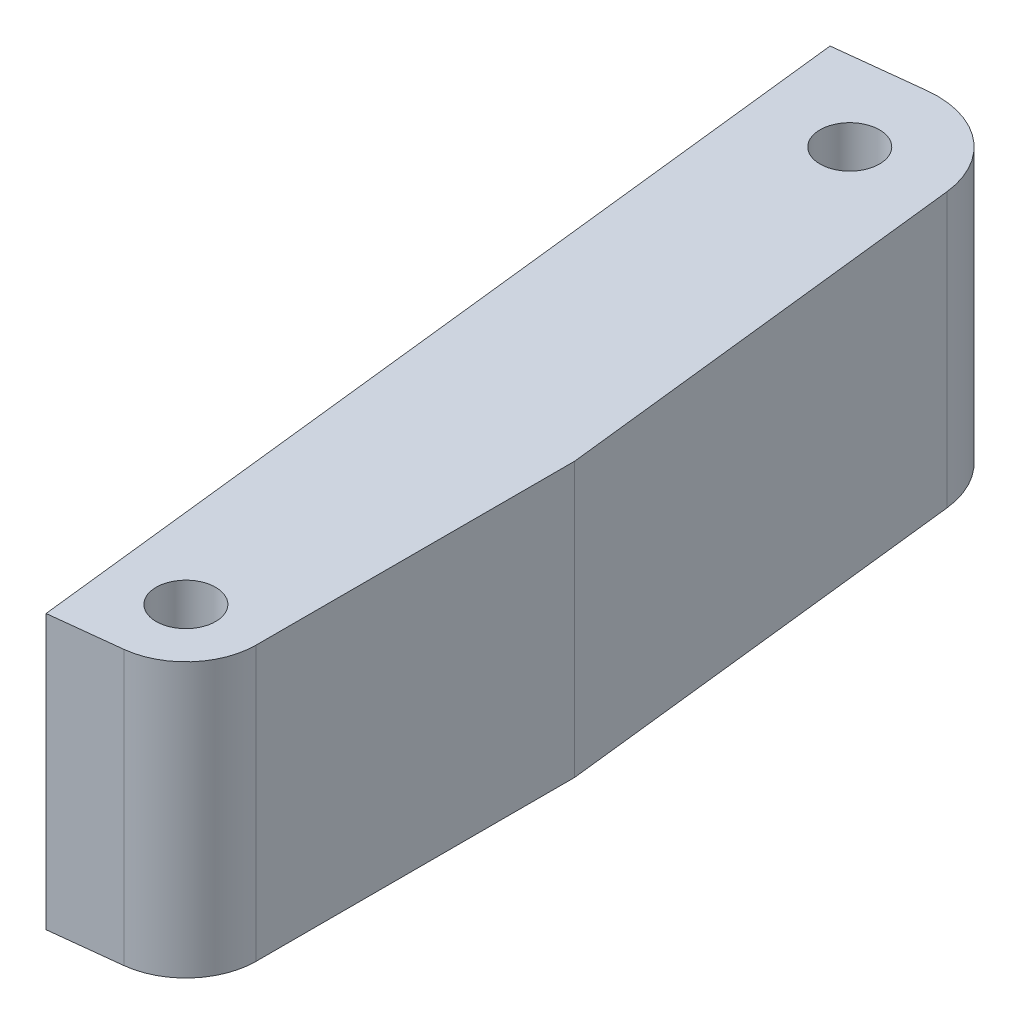
ISO-10303-21;
HEADER;
FILE_DESCRIPTION(('STEP AP214'),'2;1');
FILE_NAME('part.step','',(''),(''),'','','');
FILE_SCHEMA(('AUTOMOTIVE_DESIGN { 1 0 10303 214 1 1 1 1 }'));
ENDSEC;
DATA;
#1=APPLICATION_CONTEXT('core data for automotive mechanical design processes');
#2=APPLICATION_PROTOCOL_DEFINITION('international standard','automotive_design',2000,#1);
#3=PRODUCT_CONTEXT('',#1,'mechanical');
#4=PRODUCT('Part','Part','',(#3));
#5=PRODUCT_RELATED_PRODUCT_CATEGORY('part','',(#4));
#6=PRODUCT_DEFINITION_FORMATION('','',#4);
#7=PRODUCT_DEFINITION_CONTEXT('part definition',#1,'design');
#8=PRODUCT_DEFINITION('design','',#6,#7);
#9=PRODUCT_DEFINITION_SHAPE('','',#8);
#10=(LENGTH_UNIT() NAMED_UNIT(*) SI_UNIT(.MILLI.,.METRE.));
#11=(NAMED_UNIT(*) PLANE_ANGLE_UNIT() SI_UNIT($,.RADIAN.));
#12=(NAMED_UNIT(*) SI_UNIT($,.STERADIAN.) SOLID_ANGLE_UNIT());
#13=UNCERTAINTY_MEASURE_WITH_UNIT(LENGTH_MEASURE(1.E-05),#10,'distance_accuracy_value','');
#14=(GEOMETRIC_REPRESENTATION_CONTEXT(3) GLOBAL_UNCERTAINTY_ASSIGNED_CONTEXT((#13)) GLOBAL_UNIT_ASSIGNED_CONTEXT((#10,
#11,#12)) REPRESENTATION_CONTEXT('',''));
#15=CARTESIAN_POINT('',(0.,0.,0.));
#16=DIRECTION('',(0.,0.,1.));
#17=DIRECTION('',(1.,0.,0.));
#18=AXIS2_PLACEMENT_3D('',#15,#16,#17);
#19=CARTESIAN_POINT('',(-11.0299029445429,0.,55.3295229184585));
#20=DIRECTION('',(0.993723873247903,0.,-0.111860912463582));
#21=DIRECTION('',(-0.111860912463582,0.,-0.993723873247903));
#22=AXIS2_PLACEMENT_3D('',#19,#20,#21);
#23=PLANE('',#22);
#24=DIRECTION('',(0.111860912463582,0.,0.993723873247903));
#25=VECTOR('',#24,1.);
#26=CARTESIAN_POINT('',(-11.0299029445429,9.88749999999982,55.3295229184585));
#27=LINE('',#26,#25);
#28=CARTESIAN_POINT('',(-11.0299029436318,9.88749999999982,55.3295229265527));
#29=VERTEX_POINT('',#28);
#30=CARTESIAN_POINT('',(-7.61999999999997,9.88749999999982,85.6216230526662));
#31=VERTEX_POINT('',#30);
#32=EDGE_CURVE('E118',#29,#31,#27,.T.);
#33=ORIENTED_EDGE('',*,*,#32,.T.);
#34=DIRECTION('',(0.,1.,0.));
#35=VECTOR('',#34,1.);
#36=CARTESIAN_POINT('',(-7.61999999999997,0.,85.6216230526662));
#37=LINE('',#36,#35);
#38=CARTESIAN_POINT('',(-7.62000000000106,-9.88749999999985,85.6216230526565));
#39=VERTEX_POINT('',#38);
#40=EDGE_CURVE('E164',#39,#31,#37,.T.);
#41=ORIENTED_EDGE('',*,*,#40,.F.);
#42=DIRECTION('',(-0.111860912463582,0.,-0.993723873247903));
#43=VECTOR('',#42,1.);
#44=CARTESIAN_POINT('',(-7.61999999999997,-9.88749999999985,85.6216230526662));
#45=LINE('',#44,#43);
#46=CARTESIAN_POINT('',(-11.0299029436318,-9.88749999999985,55.3295229265527));
#47=VERTEX_POINT('',#46);
#48=EDGE_CURVE('E122',#39,#47,#45,.T.);
#49=ORIENTED_EDGE('',*,*,#48,.T.);
#50=DIRECTION('',(0.,-1.,0.));
#51=VECTOR('',#50,1.);
#52=CARTESIAN_POINT('',(-11.0299029445429,0.,55.3295229184585));
#53=LINE('',#52,#51);
#54=EDGE_CURVE('E83',#29,#47,#53,.T.);
#55=ORIENTED_EDGE('',*,*,#54,.F.);
#56=EDGE_LOOP('',(#33,#41,#49,#55));
#57=FACE_BOUND('',#56,.T.);
#58=ADVANCED_FACE('F17',(#57),#23,.T.);
#59=CARTESIAN_POINT('',(-7.61999999999997,0.,85.6216230526662));
#60=DIRECTION('',(1.,0.,0.));
#61=DIRECTION('',(0.,0.,-1.));
#62=AXIS2_PLACEMENT_3D('',#59,#60,#61);
#63=PLANE('',#62);
#64=DIRECTION('',(0.,0.,-1.));
#65=VECTOR('',#64,1.);
#66=CARTESIAN_POINT('',(-7.61999999999997,9.88749999999982,81.9598120914848));
#67=LINE('',#66,#65);
#68=CARTESIAN_POINT('',(-7.62000000000079,9.88749999999982,108.613413739759));
#69=VERTEX_POINT('',#68);
#70=EDGE_CURVE('E116',#31,#69,#67,.F.);
#71=ORIENTED_EDGE('',*,*,#70,.T.);
#72=DIRECTION('',(0.,-1.,0.));
#73=VECTOR('',#72,1.);
#74=CARTESIAN_POINT('',(-7.6200000000016,0.,108.613413739759));
#75=LINE('',#74,#73);
#76=CARTESIAN_POINT('',(-7.6200000000016,-9.88749999999985,108.613413739759));
#77=VERTEX_POINT('',#76);
#78=EDGE_CURVE('E162',#77,#69,#75,.F.);
#79=ORIENTED_EDGE('',*,*,#78,.F.);
#80=DIRECTION('',(0.,0.,1.));
#81=VECTOR('',#80,1.);
#82=CARTESIAN_POINT('',(-7.6200000000016,-9.88749999999985,81.9598120914848));
#83=LINE('',#82,#81);
#84=EDGE_CURVE('E80',#77,#39,#83,.F.);
#85=ORIENTED_EDGE('',*,*,#84,.T.);
#86=ORIENTED_EDGE('',*,*,#40,.T.);
#87=EDGE_LOOP('',(#71,#79,#85,#86));
#88=FACE_BOUND('',#87,.T.);
#89=ADVANCED_FACE('F169',(#88),#63,.T.);
#90=CARTESIAN_POINT('',(-12.7000000000016,0.,108.613413739759));
#91=DIRECTION('',(0.,-1.,0.));
#92=DIRECTION('',(0.,0.,-1.));
#93=AXIS2_PLACEMENT_3D('',#90,#91,#92);
#94=CYLINDRICAL_SURFACE('',#93,5.07999999999998);
#95=CARTESIAN_POINT('',(-12.7000000000016,9.88749999999982,108.613413739759));
#96=DIRECTION('',(0.,-1.,0.));
#97=DIRECTION('',(0.,0.,-1.));
#98=AXIS2_PLACEMENT_3D('',#95,#96,#97);
#99=CIRCLE('',#98,5.07999999999998);
#100=CARTESIAN_POINT('',(-12.1317465559699,9.88749999999982,113.661531014878));
#101=VERTEX_POINT('',#100);
#102=EDGE_CURVE('E88',#69,#101,#99,.T.);
#103=ORIENTED_EDGE('',*,*,#102,.T.);
#104=DIRECTION('',(0.,1.,0.));
#105=VECTOR('',#104,1.);
#106=CARTESIAN_POINT('',(-12.1317465559698,0.,113.661531014878));
#107=LINE('',#106,#105);
#108=CARTESIAN_POINT('',(-12.1317465559699,-9.88749999999985,113.661531014878));
#109=VERTEX_POINT('',#108);
#110=EDGE_CURVE('E85',#109,#101,#107,.T.);
#111=ORIENTED_EDGE('',*,*,#110,.F.);
#112=CARTESIAN_POINT('',(-12.7000000000016,-9.88749999999985,108.613413739759));
#113=DIRECTION('',(0.,-1.,0.));
#114=DIRECTION('',(0.,0.,-1.));
#115=AXIS2_PLACEMENT_3D('',#112,#113,#114);
#116=CIRCLE('',#115,5.07999999999998);
#117=EDGE_CURVE('E20',#109,#77,#116,.F.);
#118=ORIENTED_EDGE('',*,*,#117,.T.);
#119=ORIENTED_EDGE('',*,*,#78,.T.);
#120=EDGE_LOOP('',(#103,#111,#118,#119));
#121=FACE_BOUND('',#120,.T.);
#122=ADVANCED_FACE('F86',(#121),#94,.T.);
#123=CARTESIAN_POINT('',(-12.7000000000016,-2.85875000000017,108.613413739759));
#124=DIRECTION('',(0.,1.,0.));
#125=DIRECTION('',(0.,0.,1.));
#126=AXIS2_PLACEMENT_3D('',#123,#124,#125);
#127=CYLINDRICAL_SURFACE('',#126,2.1463);
#128=CARTESIAN_POINT('',(-12.7000000000016,9.88749999999982,108.613413739759));
#129=DIRECTION('',(0.,1.,0.));
#130=DIRECTION('',(0.,0.,1.));
#131=AXIS2_PLACEMENT_3D('',#128,#129,#130);
#132=CIRCLE('',#131,2.1463);
#133=CARTESIAN_POINT('',(-12.7000000000016,9.88749999999982,110.759713739759));
#134=VERTEX_POINT('',#133);
#135=EDGE_CURVE('E111',#134,#134,#132,.T.);
#136=ORIENTED_EDGE('',*,*,#135,.T.);
#137=EDGE_LOOP('',(#136));
#138=FACE_BOUND('',#137,.T.);
#139=CARTESIAN_POINT('',(-12.7000000000016,-9.88749999999985,108.613413739759));
#140=DIRECTION('',(0.,1.,0.));
#141=DIRECTION('',(0.,0.,1.));
#142=AXIS2_PLACEMENT_3D('',#139,#140,#141);
#143=CIRCLE('',#142,2.1463);
#144=CARTESIAN_POINT('',(-12.7000000000016,-9.88749999999985,110.759713739759));
#145=VERTEX_POINT('',#144);
#146=EDGE_CURVE('E100',#145,#145,#143,.F.);
#147=ORIENTED_EDGE('',*,*,#146,.T.);
#148=EDGE_LOOP('',(#147));
#149=FACE_BOUND('',#148,.T.);
#150=ADVANCED_FACE('F209',(#138,#149),#127,.F.);
#151=CARTESIAN_POINT('',(-17.3400495431374,-2.85875000000017,56.0398397293865));
#152=DIRECTION('',(0.,1.,0.));
#153=DIRECTION('',(0.,0.,1.));
#154=AXIS2_PLACEMENT_3D('',#151,#152,#153);
#155=CYLINDRICAL_SURFACE('',#154,2.1463);
#156=CARTESIAN_POINT('',(-17.3400495431374,9.88749999999982,56.0398397293865));
#157=DIRECTION('',(0.,1.,0.));
#158=DIRECTION('',(0.,0.,1.));
#159=AXIS2_PLACEMENT_3D('',#156,#157,#158);
#160=CIRCLE('',#159,2.1463);
#161=CARTESIAN_POINT('',(-17.3400495431374,9.88749999999982,58.1861397293865));
#162=VERTEX_POINT('',#161);
#163=EDGE_CURVE('E107',#162,#162,#160,.T.);
#164=ORIENTED_EDGE('',*,*,#163,.T.);
#165=EDGE_LOOP('',(#164));
#166=FACE_BOUND('',#165,.T.);
#167=CARTESIAN_POINT('',(-17.3400495431374,-9.88749999999985,56.0398397293865));
#168=DIRECTION('',(0.,1.,0.));
#169=DIRECTION('',(0.,0.,1.));
#170=AXIS2_PLACEMENT_3D('',#167,#168,#169);
#171=CIRCLE('',#170,2.1463);
#172=CARTESIAN_POINT('',(-17.3400495431374,-9.88749999999985,58.1861397293865));
#173=VERTEX_POINT('',#172);
#174=EDGE_CURVE('E97',#173,#173,#171,.F.);
#175=ORIENTED_EDGE('',*,*,#174,.T.);
#176=EDGE_LOOP('',(#175));
#177=FACE_BOUND('',#176,.T.);
#178=ADVANCED_FACE('F206',(#166,#177),#155,.F.);
#179=CARTESIAN_POINT('',(-17.3400495431374,0.,56.0398397293865));
#180=DIRECTION('',(0.,-1.,0.));
#181=DIRECTION('',(0.,0.,-1.));
#182=AXIS2_PLACEMENT_3D('',#179,#180,#181);
#183=CYLINDRICAL_SURFACE('',#182,6.35000000532597);
#184=CARTESIAN_POINT('',(-17.3400495431374,9.88749999999982,56.0398397293865));
#185=DIRECTION('',(0.,-1.,0.));
#186=DIRECTION('',(0.,0.,-1.));
#187=AXIS2_PLACEMENT_3D('',#184,#185,#186);
#188=CIRCLE('',#187,6.35000000532597);
#189=CARTESIAN_POINT('',(-18.05036637228,9.88749999999982,49.7296931328423));
#190=VERTEX_POINT('',#189);
#191=EDGE_CURVE('E91',#190,#29,#188,.T.);
#192=ORIENTED_EDGE('',*,*,#191,.T.);
#193=ORIENTED_EDGE('',*,*,#54,.T.);
#194=CARTESIAN_POINT('',(-17.3400495431374,-9.88749999999985,56.0398397293865));
#195=DIRECTION('',(0.,-1.,0.));
#196=DIRECTION('',(0.,0.,-1.));
#197=AXIS2_PLACEMENT_3D('',#194,#195,#196);
#198=CIRCLE('',#197,6.35000000532597);
#199=CARTESIAN_POINT('',(-18.05036637228,-9.88749999999985,49.7296931328423));
#200=VERTEX_POINT('',#199);
#201=EDGE_CURVE('E121',#47,#200,#198,.F.);
#202=ORIENTED_EDGE('',*,*,#201,.T.);
#203=DIRECTION('',(0.,1.,0.));
#204=VECTOR('',#203,1.);
#205=CARTESIAN_POINT('',(-18.0503663957872,0.,49.7296931354885));
#206=LINE('',#205,#204);
#207=EDGE_CURVE('E139',#190,#200,#206,.F.);
#208=ORIENTED_EDGE('',*,*,#207,.F.);
#209=EDGE_LOOP('',(#192,#193,#202,#208));
#210=FACE_BOUND('',#209,.T.);
#211=ADVANCED_FACE('F183',(#210),#183,.T.);
#212=CARTESIAN_POINT('',(-15.9902564948425,-9.88749999999985,81.9598120914848));
#213=DIRECTION('',(0.,1.,0.));
#214=DIRECTION('',(0.,0.,1.));
#215=AXIS2_PLACEMENT_3D('',#212,#213,#214);
#216=PLANE('',#215);
#217=ORIENTED_EDGE('',*,*,#174,.F.);
#218=EDGE_LOOP('',(#217));
#219=FACE_BOUND('',#218,.T.);
#220=ORIENTED_EDGE('',*,*,#146,.F.);
#221=EDGE_LOOP('',(#220));
#222=FACE_BOUND('',#221,.T.);
#223=DIRECTION('',(0.111860914179471,0.,0.99372387305475));
#224=VECTOR('',#223,1.);
#225=CARTESIAN_POINT('',(-17.179863831088,-9.88749999999985,114.229784458909));
#226=LINE('',#225,#224);
#227=CARTESIAN_POINT('',(-24.3605129896851,-9.88749999999985,50.4400099405282));
#228=VERTEX_POINT('',#227);
#229=CARTESIAN_POINT('',(-17.179863831088,-9.88749999999985,114.229784458909));
#230=VERTEX_POINT('',#229);
#231=EDGE_CURVE('E142',#228,#230,#226,.T.);
#232=ORIENTED_EDGE('',*,*,#231,.F.);
#233=DIRECTION('',(-0.99372387305475,0.,0.111860914179473));
#234=VECTOR('',#233,1.);
#235=CARTESIAN_POINT('',(-24.3605129896851,-9.88749999999985,50.4400099405282));
#236=LINE('',#235,#234);
#237=EDGE_CURVE('E110',#200,#228,#236,.T.);
#238=ORIENTED_EDGE('',*,*,#237,.F.);
#239=ORIENTED_EDGE('',*,*,#201,.F.);
#240=ORIENTED_EDGE('',*,*,#48,.F.);
#241=ORIENTED_EDGE('',*,*,#84,.F.);
#242=ORIENTED_EDGE('',*,*,#117,.F.);
#243=DIRECTION('',(0.993723873054751,0.,-0.111860914179466));
#244=VECTOR('',#243,1.);
#245=CARTESIAN_POINT('',(-12.1317465559698,-9.88749999999985,113.661531014878));
#246=LINE('',#245,#244);
#247=EDGE_CURVE('E76',#230,#109,#246,.T.);
#248=ORIENTED_EDGE('',*,*,#247,.F.);
#249=EDGE_LOOP('',(#232,#238,#239,#240,#241,#242,#248));
#250=FACE_BOUND('',#249,.T.);
#251=ADVANCED_FACE('F74',(#219,#222,#250),#216,.F.);
#252=CARTESIAN_POINT('',(-12.1317465559698,0.,113.661531014878));
#253=DIRECTION('',(0.111860914179466,0.,0.993723873054751));
#254=DIRECTION('',(0.993723873054751,0.,-0.111860914179466));
#255=AXIS2_PLACEMENT_3D('',#252,#253,#254);
#256=PLANE('',#255);
#257=DIRECTION('',(-0.993723873054753,0.,0.11186091417945));
#258=VECTOR('',#257,1.);
#259=CARTESIAN_POINT('',(-12.1317465559698,9.88749999999982,113.661531014878));
#260=LINE('',#259,#258);
#261=CARTESIAN_POINT('',(-17.179863831088,9.88749999999982,114.229784458909));
#262=VERTEX_POINT('',#261);
#263=EDGE_CURVE('E114',#101,#262,#260,.T.);
#264=ORIENTED_EDGE('',*,*,#263,.T.);
#265=DIRECTION('',(0.,1.,0.));
#266=VECTOR('',#265,1.);
#267=CARTESIAN_POINT('',(-17.179863831088,0.,114.229784458909));
#268=LINE('',#267,#266);
#269=EDGE_CURVE('E95',#230,#262,#268,.T.);
#270=ORIENTED_EDGE('',*,*,#269,.F.);
#271=ORIENTED_EDGE('',*,*,#247,.T.);
#272=ORIENTED_EDGE('',*,*,#110,.T.);
#273=EDGE_LOOP('',(#264,#270,#271,#272));
#274=FACE_BOUND('',#273,.T.);
#275=ADVANCED_FACE('F93',(#274),#256,.T.);
#276=CARTESIAN_POINT('',(-15.9902564948425,9.88749999999982,81.9598120914848));
#277=DIRECTION('',(0.,-1.,0.));
#278=DIRECTION('',(0.,0.,-1.));
#279=AXIS2_PLACEMENT_3D('',#276,#277,#278);
#280=PLANE('',#279);
#281=ORIENTED_EDGE('',*,*,#163,.F.);
#282=EDGE_LOOP('',(#281));
#283=FACE_BOUND('',#282,.T.);
#284=ORIENTED_EDGE('',*,*,#135,.F.);
#285=EDGE_LOOP('',(#284));
#286=FACE_BOUND('',#285,.T.);
#287=DIRECTION('',(0.111860914179471,0.,0.99372387305475));
#288=VECTOR('',#287,1.);
#289=CARTESIAN_POINT('',(-17.179863831088,9.88749999999982,114.229784458909));
#290=LINE('',#289,#288);
#291=CARTESIAN_POINT('',(-24.3605129896851,9.88749999999982,50.4400099405282));
#292=VERTEX_POINT('',#291);
#293=EDGE_CURVE('E26',#262,#292,#290,.F.);
#294=ORIENTED_EDGE('',*,*,#293,.F.);
#295=ORIENTED_EDGE('',*,*,#263,.F.);
#296=ORIENTED_EDGE('',*,*,#102,.F.);
#297=ORIENTED_EDGE('',*,*,#70,.F.);
#298=ORIENTED_EDGE('',*,*,#32,.F.);
#299=ORIENTED_EDGE('',*,*,#191,.F.);
#300=DIRECTION('',(-0.99372387305475,0.,0.111860914179473));
#301=VECTOR('',#300,1.);
#302=CARTESIAN_POINT('',(-24.3605129896851,9.88749999999982,50.4400099405282));
#303=LINE('',#302,#301);
#304=EDGE_CURVE('E35',#292,#190,#303,.F.);
#305=ORIENTED_EDGE('',*,*,#304,.F.);
#306=EDGE_LOOP('',(#294,#295,#296,#297,#298,#299,#305));
#307=FACE_BOUND('',#306,.T.);
#308=ADVANCED_FACE('F172',(#283,#286,#307),#280,.F.);
#309=CARTESIAN_POINT('',(-24.3605129896851,0.,50.4400099405282));
#310=DIRECTION('',(-0.111860914179473,0.,-0.99372387305475));
#311=DIRECTION('',(-0.99372387305475,0.,0.111860914179473));
#312=AXIS2_PLACEMENT_3D('',#309,#310,#311);
#313=PLANE('',#312);
#314=ORIENTED_EDGE('',*,*,#304,.T.);
#315=ORIENTED_EDGE('',*,*,#207,.T.);
#316=ORIENTED_EDGE('',*,*,#237,.T.);
#317=DIRECTION('',(0.,1.,0.));
#318=VECTOR('',#317,1.);
#319=CARTESIAN_POINT('',(-24.3605129896851,0.,50.4400099405281));
#320=LINE('',#319,#318);
#321=EDGE_CURVE('E11',#292,#228,#320,.F.);
#322=ORIENTED_EDGE('',*,*,#321,.F.);
#323=EDGE_LOOP('',(#314,#315,#316,#322));
#324=FACE_BOUND('',#323,.T.);
#325=ADVANCED_FACE('F182',(#324),#313,.T.);
#326=CARTESIAN_POINT('',(-17.179863831088,0.,114.229784458909));
#327=DIRECTION('',(-0.99372387305475,0.,0.111860914179471));
#328=DIRECTION('',(0.111860914179471,0.,0.99372387305475));
#329=AXIS2_PLACEMENT_3D('',#326,#327,#328);
#330=PLANE('',#329);
#331=ORIENTED_EDGE('',*,*,#293,.T.);
#332=ORIENTED_EDGE('',*,*,#321,.T.);
#333=ORIENTED_EDGE('',*,*,#231,.T.);
#334=ORIENTED_EDGE('',*,*,#269,.T.);
#335=EDGE_LOOP('',(#331,#332,#333,#334));
#336=FACE_BOUND('',#335,.T.);
#337=ADVANCED_FACE('F180',(#336),#330,.T.);
#338=CLOSED_SHELL('',(#58,#89,#122,#150,#178,#211,#251,#275,#308,#325,#337));
#339=MANIFOLD_SOLID_BREP('B1',#338);
#340=ADVANCED_BREP_SHAPE_REPRESENTATION('',(#18,#339),#14);
#341=SHAPE_DEFINITION_REPRESENTATION(#9,#340);
ENDSEC;
END-ISO-10303-21;
